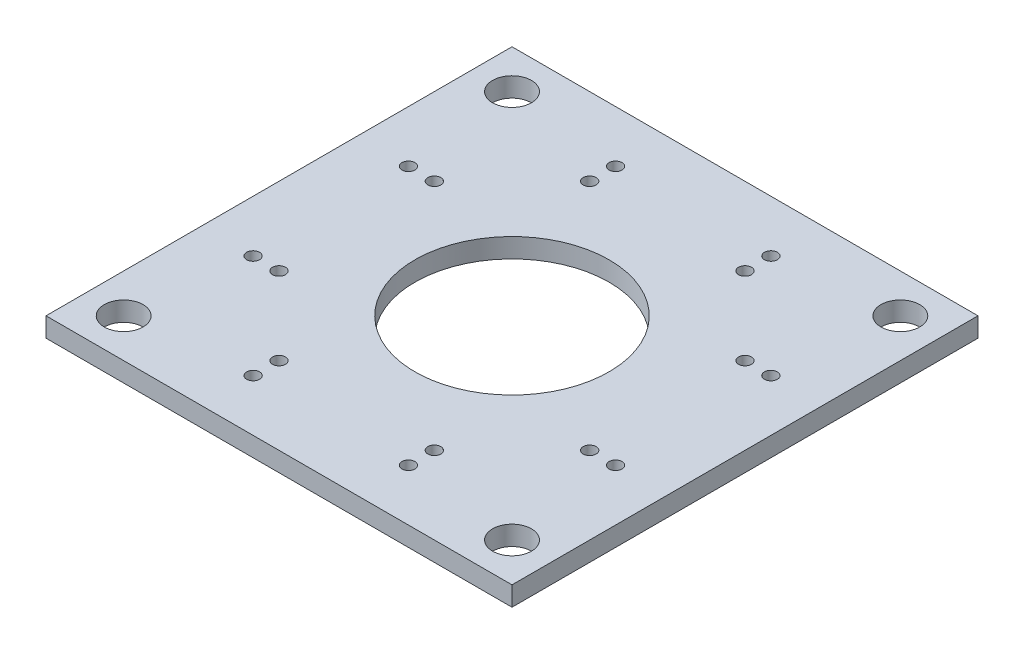
ISO-10303-21;
HEADER;
FILE_DESCRIPTION(('STEP AP214'),'2;1');
FILE_NAME('part.step','',(''),(''),'','','');
FILE_SCHEMA(('AUTOMOTIVE_DESIGN { 1 0 10303 214 1 1 1 1 }'));
ENDSEC;
DATA;
#1=APPLICATION_CONTEXT('core data for automotive mechanical design processes');
#2=APPLICATION_PROTOCOL_DEFINITION('international standard','automotive_design',2000,#1);
#3=PRODUCT_CONTEXT('',#1,'mechanical');
#4=PRODUCT('Part','Part','',(#3));
#5=PRODUCT_RELATED_PRODUCT_CATEGORY('part','',(#4));
#6=PRODUCT_DEFINITION_FORMATION('','',#4);
#7=PRODUCT_DEFINITION_CONTEXT('part definition',#1,'design');
#8=PRODUCT_DEFINITION('design','',#6,#7);
#9=PRODUCT_DEFINITION_SHAPE('','',#8);
#10=(LENGTH_UNIT() NAMED_UNIT(*) SI_UNIT(.MILLI.,.METRE.));
#11=(NAMED_UNIT(*) PLANE_ANGLE_UNIT() SI_UNIT($,.RADIAN.));
#12=(NAMED_UNIT(*) SI_UNIT($,.STERADIAN.) SOLID_ANGLE_UNIT());
#13=UNCERTAINTY_MEASURE_WITH_UNIT(LENGTH_MEASURE(1.E-05),#10,'distance_accuracy_value','');
#14=(GEOMETRIC_REPRESENTATION_CONTEXT(3) GLOBAL_UNCERTAINTY_ASSIGNED_CONTEXT((#13)) GLOBAL_UNIT_ASSIGNED_CONTEXT((#10,
#11,#12)) REPRESENTATION_CONTEXT('',''));
#15=CARTESIAN_POINT('',(0.,0.,0.));
#16=DIRECTION('',(0.,0.,1.));
#17=DIRECTION('',(1.,0.,0.));
#18=AXIS2_PLACEMENT_3D('',#15,#16,#17);
#19=CARTESIAN_POINT('',(0.,1.5,0.));
#20=DIRECTION('',(0.,1.,0.));
#21=DIRECTION('',(0.,0.,1.));
#22=AXIS2_PLACEMENT_3D('',#19,#20,#21);
#23=PLANE('',#22);
#24=CARTESIAN_POINT('',(-15.,1.5,15.));
#25=DIRECTION('',(0.,1.,0.));
#26=DIRECTION('',(0.,0.,1.));
#27=AXIS2_PLACEMENT_3D('',#24,#25,#26);
#28=CIRCLE('',#27,1.5);
#29=CARTESIAN_POINT('',(-15.,1.5,16.5));
#30=VERTEX_POINT('',#29);
#31=EDGE_CURVE('E142',#30,#30,#28,.F.);
#32=ORIENTED_EDGE('',*,*,#31,.T.);
#33=EDGE_LOOP('',(#32));
#34=FACE_BOUND('',#33,.T.);
#35=CARTESIAN_POINT('',(15.,1.5,15.));
#36=DIRECTION('',(0.,1.,0.));
#37=DIRECTION('',(0.,0.,1.));
#38=AXIS2_PLACEMENT_3D('',#35,#36,#37);
#39=CIRCLE('',#38,1.5);
#40=CARTESIAN_POINT('',(15.,1.5,16.5));
#41=VERTEX_POINT('',#40);
#42=EDGE_CURVE('E145',#41,#41,#39,.F.);
#43=ORIENTED_EDGE('',*,*,#42,.T.);
#44=EDGE_LOOP('',(#43));
#45=FACE_BOUND('',#44,.T.);
#46=CARTESIAN_POINT('',(15.,1.5,-15.));
#47=DIRECTION('',(0.,1.,0.));
#48=DIRECTION('',(0.,0.,1.));
#49=AXIS2_PLACEMENT_3D('',#46,#47,#48);
#50=CIRCLE('',#49,1.5);
#51=CARTESIAN_POINT('',(15.,1.5,-13.5));
#52=VERTEX_POINT('',#51);
#53=EDGE_CURVE('E148',#52,#52,#50,.F.);
#54=ORIENTED_EDGE('',*,*,#53,.T.);
#55=EDGE_LOOP('',(#54));
#56=FACE_BOUND('',#55,.T.);
#57=CARTESIAN_POINT('',(-15.,1.5,-15.));
#58=DIRECTION('',(0.,1.,0.));
#59=DIRECTION('',(0.,0.,1.));
#60=AXIS2_PLACEMENT_3D('',#57,#58,#59);
#61=CIRCLE('',#60,1.5);
#62=CARTESIAN_POINT('',(-15.,1.5,-13.5));
#63=VERTEX_POINT('',#62);
#64=EDGE_CURVE('E151',#63,#63,#61,.F.);
#65=ORIENTED_EDGE('',*,*,#64,.T.);
#66=EDGE_LOOP('',(#65));
#67=FACE_BOUND('',#66,.T.);
#68=CARTESIAN_POINT('',(0.,1.5,0.));
#69=DIRECTION('',(0.,-1.,0.));
#70=DIRECTION('',(0.,0.,-1.));
#71=AXIS2_PLACEMENT_3D('',#68,#69,#70);
#72=CIRCLE('',#71,7.5);
#73=CARTESIAN_POINT('',(0.,1.5,-7.5));
#74=VERTEX_POINT('',#73);
#75=EDGE_CURVE('E154',#74,#74,#72,.T.);
#76=ORIENTED_EDGE('',*,*,#75,.T.);
#77=EDGE_LOOP('',(#76));
#78=FACE_BOUND('',#77,.T.);
#79=CARTESIAN_POINT('',(12.,1.5,6.));
#80=DIRECTION('',(0.,1.,0.));
#81=DIRECTION('',(0.,0.,1.));
#82=AXIS2_PLACEMENT_3D('',#79,#80,#81);
#83=CIRCLE('',#82,0.5);
#84=CARTESIAN_POINT('',(12.,1.5,6.5));
#85=VERTEX_POINT('',#84);
#86=EDGE_CURVE('E157',#85,#85,#83,.F.);
#87=ORIENTED_EDGE('',*,*,#86,.T.);
#88=EDGE_LOOP('',(#87));
#89=FACE_BOUND('',#88,.T.);
#90=CARTESIAN_POINT('',(14.,1.5,6.));
#91=DIRECTION('',(0.,1.,0.));
#92=DIRECTION('',(0.,0.,1.));
#93=AXIS2_PLACEMENT_3D('',#90,#91,#92);
#94=CIRCLE('',#93,0.5);
#95=CARTESIAN_POINT('',(14.,1.5,6.5));
#96=VERTEX_POINT('',#95);
#97=EDGE_CURVE('E160',#96,#96,#94,.F.);
#98=ORIENTED_EDGE('',*,*,#97,.T.);
#99=EDGE_LOOP('',(#98));
#100=FACE_BOUND('',#99,.T.);
#101=CARTESIAN_POINT('',(12.,1.5,-6.));
#102=DIRECTION('',(0.,1.,0.));
#103=DIRECTION('',(0.,0.,1.));
#104=AXIS2_PLACEMENT_3D('',#101,#102,#103);
#105=CIRCLE('',#104,0.5);
#106=CARTESIAN_POINT('',(12.,1.5,-5.5));
#107=VERTEX_POINT('',#106);
#108=EDGE_CURVE('E163',#107,#107,#105,.F.);
#109=ORIENTED_EDGE('',*,*,#108,.T.);
#110=EDGE_LOOP('',(#109));
#111=FACE_BOUND('',#110,.T.);
#112=CARTESIAN_POINT('',(14.,1.5,-6.));
#113=DIRECTION('',(0.,1.,0.));
#114=DIRECTION('',(0.,0.,1.));
#115=AXIS2_PLACEMENT_3D('',#112,#113,#114);
#116=CIRCLE('',#115,0.5);
#117=CARTESIAN_POINT('',(14.,1.5,-5.5));
#118=VERTEX_POINT('',#117);
#119=EDGE_CURVE('E166',#118,#118,#116,.F.);
#120=ORIENTED_EDGE('',*,*,#119,.T.);
#121=EDGE_LOOP('',(#120));
#122=FACE_BOUND('',#121,.T.);
#123=CARTESIAN_POINT('',(-12.,1.5,6.));
#124=DIRECTION('',(0.,1.,0.));
#125=DIRECTION('',(0.,0.,1.));
#126=AXIS2_PLACEMENT_3D('',#123,#124,#125);
#127=CIRCLE('',#126,0.5);
#128=CARTESIAN_POINT('',(-12.,1.5,6.5));
#129=VERTEX_POINT('',#128);
#130=EDGE_CURVE('E169',#129,#129,#127,.F.);
#131=ORIENTED_EDGE('',*,*,#130,.T.);
#132=EDGE_LOOP('',(#131));
#133=FACE_BOUND('',#132,.T.);
#134=CARTESIAN_POINT('',(-14.,1.5,6.));
#135=DIRECTION('',(0.,1.,0.));
#136=DIRECTION('',(0.,0.,1.));
#137=AXIS2_PLACEMENT_3D('',#134,#135,#136);
#138=CIRCLE('',#137,0.5);
#139=CARTESIAN_POINT('',(-14.,1.5,6.5));
#140=VERTEX_POINT('',#139);
#141=EDGE_CURVE('E172',#140,#140,#138,.F.);
#142=ORIENTED_EDGE('',*,*,#141,.T.);
#143=EDGE_LOOP('',(#142));
#144=FACE_BOUND('',#143,.T.);
#145=CARTESIAN_POINT('',(-12.,1.5,-6.));
#146=DIRECTION('',(0.,1.,0.));
#147=DIRECTION('',(0.,0.,1.));
#148=AXIS2_PLACEMENT_3D('',#145,#146,#147);
#149=CIRCLE('',#148,0.5);
#150=CARTESIAN_POINT('',(-12.,1.5,-5.5));
#151=VERTEX_POINT('',#150);
#152=EDGE_CURVE('E175',#151,#151,#149,.F.);
#153=ORIENTED_EDGE('',*,*,#152,.T.);
#154=EDGE_LOOP('',(#153));
#155=FACE_BOUND('',#154,.T.);
#156=CARTESIAN_POINT('',(-14.,1.5,-6.));
#157=DIRECTION('',(0.,1.,0.));
#158=DIRECTION('',(0.,0.,1.));
#159=AXIS2_PLACEMENT_3D('',#156,#157,#158);
#160=CIRCLE('',#159,0.5);
#161=CARTESIAN_POINT('',(-14.,1.5,-5.5));
#162=VERTEX_POINT('',#161);
#163=EDGE_CURVE('E178',#162,#162,#160,.F.);
#164=ORIENTED_EDGE('',*,*,#163,.T.);
#165=EDGE_LOOP('',(#164));
#166=FACE_BOUND('',#165,.T.);
#167=CARTESIAN_POINT('',(6.,1.5,12.));
#168=DIRECTION('',(0.,1.,0.));
#169=DIRECTION('',(0.,0.,1.));
#170=AXIS2_PLACEMENT_3D('',#167,#168,#169);
#171=CIRCLE('',#170,0.5);
#172=CARTESIAN_POINT('',(6.,1.5,12.5));
#173=VERTEX_POINT('',#172);
#174=EDGE_CURVE('E181',#173,#173,#171,.F.);
#175=ORIENTED_EDGE('',*,*,#174,.T.);
#176=EDGE_LOOP('',(#175));
#177=FACE_BOUND('',#176,.T.);
#178=CARTESIAN_POINT('',(6.,1.5,14.));
#179=DIRECTION('',(0.,1.,0.));
#180=DIRECTION('',(0.,0.,1.));
#181=AXIS2_PLACEMENT_3D('',#178,#179,#180);
#182=CIRCLE('',#181,0.5);
#183=CARTESIAN_POINT('',(6.,1.5,14.5));
#184=VERTEX_POINT('',#183);
#185=EDGE_CURVE('E184',#184,#184,#182,.F.);
#186=ORIENTED_EDGE('',*,*,#185,.T.);
#187=EDGE_LOOP('',(#186));
#188=FACE_BOUND('',#187,.T.);
#189=CARTESIAN_POINT('',(-6.,1.5,12.));
#190=DIRECTION('',(0.,1.,0.));
#191=DIRECTION('',(0.,0.,1.));
#192=AXIS2_PLACEMENT_3D('',#189,#190,#191);
#193=CIRCLE('',#192,0.5);
#194=CARTESIAN_POINT('',(-6.,1.5,12.5));
#195=VERTEX_POINT('',#194);
#196=EDGE_CURVE('E187',#195,#195,#193,.F.);
#197=ORIENTED_EDGE('',*,*,#196,.T.);
#198=EDGE_LOOP('',(#197));
#199=FACE_BOUND('',#198,.T.);
#200=CARTESIAN_POINT('',(-6.,1.5,14.));
#201=DIRECTION('',(0.,1.,0.));
#202=DIRECTION('',(0.,0.,1.));
#203=AXIS2_PLACEMENT_3D('',#200,#201,#202);
#204=CIRCLE('',#203,0.5);
#205=CARTESIAN_POINT('',(-6.,1.5,14.5));
#206=VERTEX_POINT('',#205);
#207=EDGE_CURVE('E190',#206,#206,#204,.F.);
#208=ORIENTED_EDGE('',*,*,#207,.T.);
#209=EDGE_LOOP('',(#208));
#210=FACE_BOUND('',#209,.T.);
#211=CARTESIAN_POINT('',(6.,1.5,-12.));
#212=DIRECTION('',(0.,1.,0.));
#213=DIRECTION('',(0.,0.,1.));
#214=AXIS2_PLACEMENT_3D('',#211,#212,#213);
#215=CIRCLE('',#214,0.5);
#216=CARTESIAN_POINT('',(6.,1.5,-11.5));
#217=VERTEX_POINT('',#216);
#218=EDGE_CURVE('E193',#217,#217,#215,.F.);
#219=ORIENTED_EDGE('',*,*,#218,.T.);
#220=EDGE_LOOP('',(#219));
#221=FACE_BOUND('',#220,.T.);
#222=CARTESIAN_POINT('',(6.,1.5,-14.));
#223=DIRECTION('',(0.,1.,0.));
#224=DIRECTION('',(0.,0.,1.));
#225=AXIS2_PLACEMENT_3D('',#222,#223,#224);
#226=CIRCLE('',#225,0.5);
#227=CARTESIAN_POINT('',(6.,1.5,-13.5));
#228=VERTEX_POINT('',#227);
#229=EDGE_CURVE('E196',#228,#228,#226,.F.);
#230=ORIENTED_EDGE('',*,*,#229,.T.);
#231=EDGE_LOOP('',(#230));
#232=FACE_BOUND('',#231,.T.);
#233=CARTESIAN_POINT('',(-6.,1.5,-12.));
#234=DIRECTION('',(0.,1.,0.));
#235=DIRECTION('',(0.,0.,1.));
#236=AXIS2_PLACEMENT_3D('',#233,#234,#235);
#237=CIRCLE('',#236,0.5);
#238=CARTESIAN_POINT('',(-6.,1.5,-11.5));
#239=VERTEX_POINT('',#238);
#240=EDGE_CURVE('E198',#239,#239,#237,.F.);
#241=ORIENTED_EDGE('',*,*,#240,.T.);
#242=EDGE_LOOP('',(#241));
#243=FACE_BOUND('',#242,.T.);
#244=CARTESIAN_POINT('',(-6.,1.5,-14.));
#245=DIRECTION('',(0.,1.,0.));
#246=DIRECTION('',(0.,0.,1.));
#247=AXIS2_PLACEMENT_3D('',#244,#245,#246);
#248=CIRCLE('',#247,0.5);
#249=CARTESIAN_POINT('',(-6.,1.5,-13.5));
#250=VERTEX_POINT('',#249);
#251=EDGE_CURVE('E19',#250,#250,#248,.F.);
#252=ORIENTED_EDGE('',*,*,#251,.T.);
#253=EDGE_LOOP('',(#252));
#254=FACE_BOUND('',#253,.T.);
#255=DIRECTION('',(-1.,0.,0.));
#256=VECTOR('',#255,1.);
#257=CARTESIAN_POINT('',(18.,1.5,-18.));
#258=LINE('',#257,#256);
#259=CARTESIAN_POINT('',(-18.,1.5,-18.));
#260=VERTEX_POINT('',#259);
#261=CARTESIAN_POINT('',(18.,1.5,-18.));
#262=VERTEX_POINT('',#261);
#263=EDGE_CURVE('E70',#260,#262,#258,.F.);
#264=ORIENTED_EDGE('',*,*,#263,.F.);
#265=DIRECTION('',(0.,0.,1.));
#266=VECTOR('',#265,1.);
#267=CARTESIAN_POINT('',(-18.,1.5,-18.));
#268=LINE('',#267,#266);
#269=CARTESIAN_POINT('',(-18.,1.5,18.));
#270=VERTEX_POINT('',#269);
#271=EDGE_CURVE('E67',#270,#260,#268,.F.);
#272=ORIENTED_EDGE('',*,*,#271,.F.);
#273=DIRECTION('',(1.,0.,0.));
#274=VECTOR('',#273,1.);
#275=CARTESIAN_POINT('',(-18.,1.5,18.));
#276=LINE('',#275,#274);
#277=CARTESIAN_POINT('',(18.,1.5,18.));
#278=VERTEX_POINT('',#277);
#279=EDGE_CURVE('E58',#278,#270,#276,.F.);
#280=ORIENTED_EDGE('',*,*,#279,.F.);
#281=DIRECTION('',(0.,0.,-1.));
#282=VECTOR('',#281,1.);
#283=CARTESIAN_POINT('',(18.,1.5,18.));
#284=LINE('',#283,#282);
#285=EDGE_CURVE('E53',#262,#278,#284,.F.);
#286=ORIENTED_EDGE('',*,*,#285,.F.);
#287=EDGE_LOOP('',(#264,#272,#280,#286));
#288=FACE_BOUND('',#287,.T.);
#289=ADVANCED_FACE('F16',(#34,#45,#56,#67,#78,#89,#100,#111,#122,#133,#144,#155,#166,#177,#188,
#199,#210,#221,#232,#243,#254,#288),#23,.T.);
#290=CARTESIAN_POINT('',(-18.,0.,-18.));
#291=DIRECTION('',(-1.,0.,0.));
#292=DIRECTION('',(0.,0.,1.));
#293=AXIS2_PLACEMENT_3D('',#290,#291,#292);
#294=PLANE('',#293);
#295=DIRECTION('',(0.,1.,0.));
#296=VECTOR('',#295,1.);
#297=CARTESIAN_POINT('',(-18.,0.,-18.));
#298=LINE('',#297,#296);
#299=CARTESIAN_POINT('',(-18.,0.,-18.));
#300=VERTEX_POINT('',#299);
#301=EDGE_CURVE('E206',#300,#260,#298,.T.);
#302=ORIENTED_EDGE('',*,*,#301,.F.);
#303=DIRECTION('',(0.,0.,1.));
#304=VECTOR('',#303,1.);
#305=CARTESIAN_POINT('',(-18.,0.,0.));
#306=LINE('',#305,#304);
#307=CARTESIAN_POINT('',(-18.,0.,18.));
#308=VERTEX_POINT('',#307);
#309=EDGE_CURVE('E77',#300,#308,#306,.T.);
#310=ORIENTED_EDGE('',*,*,#309,.T.);
#311=DIRECTION('',(0.,1.,0.));
#312=VECTOR('',#311,1.);
#313=CARTESIAN_POINT('',(-18.,0.,18.));
#314=LINE('',#313,#312);
#315=EDGE_CURVE('E63',#270,#308,#314,.F.);
#316=ORIENTED_EDGE('',*,*,#315,.F.);
#317=ORIENTED_EDGE('',*,*,#271,.T.);
#318=EDGE_LOOP('',(#302,#310,#316,#317));
#319=FACE_BOUND('',#318,.T.);
#320=ADVANCED_FACE('F76',(#319),#294,.T.);
#321=CARTESIAN_POINT('',(-18.,0.,18.));
#322=DIRECTION('',(0.,0.,1.));
#323=DIRECTION('',(1.,0.,0.));
#324=AXIS2_PLACEMENT_3D('',#321,#322,#323);
#325=PLANE('',#324);
#326=ORIENTED_EDGE('',*,*,#315,.T.);
#327=DIRECTION('',(1.,0.,0.));
#328=VECTOR('',#327,1.);
#329=CARTESIAN_POINT('',(0.,0.,18.));
#330=LINE('',#329,#328);
#331=CARTESIAN_POINT('',(18.,0.,18.));
#332=VERTEX_POINT('',#331);
#333=EDGE_CURVE('E217',#308,#332,#330,.T.);
#334=ORIENTED_EDGE('',*,*,#333,.T.);
#335=DIRECTION('',(0.,1.,0.));
#336=VECTOR('',#335,1.);
#337=CARTESIAN_POINT('',(18.,0.,18.));
#338=LINE('',#337,#336);
#339=EDGE_CURVE('E65',#278,#332,#338,.F.);
#340=ORIENTED_EDGE('',*,*,#339,.F.);
#341=ORIENTED_EDGE('',*,*,#279,.T.);
#342=EDGE_LOOP('',(#326,#334,#340,#341));
#343=FACE_BOUND('',#342,.T.);
#344=ADVANCED_FACE('F60',(#343),#325,.T.);
#345=CARTESIAN_POINT('',(18.,0.,18.));
#346=DIRECTION('',(1.,0.,0.));
#347=DIRECTION('',(0.,0.,-1.));
#348=AXIS2_PLACEMENT_3D('',#345,#346,#347);
#349=PLANE('',#348);
#350=ORIENTED_EDGE('',*,*,#339,.T.);
#351=DIRECTION('',(0.,0.,1.));
#352=VECTOR('',#351,1.);
#353=CARTESIAN_POINT('',(18.,0.,0.));
#354=LINE('',#353,#352);
#355=CARTESIAN_POINT('',(18.,0.,-18.));
#356=VERTEX_POINT('',#355);
#357=EDGE_CURVE('E214',#332,#356,#354,.F.);
#358=ORIENTED_EDGE('',*,*,#357,.T.);
#359=DIRECTION('',(0.,1.,0.));
#360=VECTOR('',#359,1.);
#361=CARTESIAN_POINT('',(18.,0.,-18.));
#362=LINE('',#361,#360);
#363=EDGE_CURVE('E34',#262,#356,#362,.F.);
#364=ORIENTED_EDGE('',*,*,#363,.F.);
#365=ORIENTED_EDGE('',*,*,#285,.T.);
#366=EDGE_LOOP('',(#350,#358,#364,#365));
#367=FACE_BOUND('',#366,.T.);
#368=ADVANCED_FACE('F213',(#367),#349,.T.);
#369=CARTESIAN_POINT('',(18.,0.,-18.));
#370=DIRECTION('',(0.,0.,-1.));
#371=DIRECTION('',(-1.,0.,0.));
#372=AXIS2_PLACEMENT_3D('',#369,#370,#371);
#373=PLANE('',#372);
#374=ORIENTED_EDGE('',*,*,#363,.T.);
#375=DIRECTION('',(1.,0.,0.));
#376=VECTOR('',#375,1.);
#377=CARTESIAN_POINT('',(0.,0.,-18.));
#378=LINE('',#377,#376);
#379=EDGE_CURVE('E141',#356,#300,#378,.F.);
#380=ORIENTED_EDGE('',*,*,#379,.T.);
#381=ORIENTED_EDGE('',*,*,#301,.T.);
#382=ORIENTED_EDGE('',*,*,#263,.T.);
#383=EDGE_LOOP('',(#374,#380,#381,#382));
#384=FACE_BOUND('',#383,.T.);
#385=ADVANCED_FACE('F220',(#384),#373,.T.);
#386=CARTESIAN_POINT('',(-6.,1.5,-14.));
#387=DIRECTION('',(0.,1.,0.));
#388=DIRECTION('',(0.,0.,1.));
#389=AXIS2_PLACEMENT_3D('',#386,#387,#388);
#390=CYLINDRICAL_SURFACE('',#389,0.5);
#391=ORIENTED_EDGE('',*,*,#251,.F.);
#392=EDGE_LOOP('',(#391));
#393=FACE_BOUND('',#392,.T.);
#394=CARTESIAN_POINT('',(-6.,0.,-14.));
#395=DIRECTION('',(0.,1.,0.));
#396=DIRECTION('',(0.,0.,1.));
#397=AXIS2_PLACEMENT_3D('',#394,#395,#396);
#398=CIRCLE('',#397,0.5);
#399=CARTESIAN_POINT('',(-6.,0.,-13.5));
#400=VERTEX_POINT('',#399);
#401=EDGE_CURVE('E138',#400,#400,#398,.F.);
#402=ORIENTED_EDGE('',*,*,#401,.T.);
#403=EDGE_LOOP('',(#402));
#404=FACE_BOUND('',#403,.T.);
#405=ADVANCED_FACE('F222',(#393,#404),#390,.F.);
#406=CARTESIAN_POINT('',(-6.,1.5,-12.));
#407=DIRECTION('',(0.,1.,0.));
#408=DIRECTION('',(0.,0.,1.));
#409=AXIS2_PLACEMENT_3D('',#406,#407,#408);
#410=CYLINDRICAL_SURFACE('',#409,0.5);
#411=ORIENTED_EDGE('',*,*,#240,.F.);
#412=EDGE_LOOP('',(#411));
#413=FACE_BOUND('',#412,.T.);
#414=CARTESIAN_POINT('',(-6.,0.,-12.));
#415=DIRECTION('',(0.,1.,0.));
#416=DIRECTION('',(0.,0.,1.));
#417=AXIS2_PLACEMENT_3D('',#414,#415,#416);
#418=CIRCLE('',#417,0.5);
#419=CARTESIAN_POINT('',(-6.,0.,-11.5));
#420=VERTEX_POINT('',#419);
#421=EDGE_CURVE('E135',#420,#420,#418,.F.);
#422=ORIENTED_EDGE('',*,*,#421,.T.);
#423=EDGE_LOOP('',(#422));
#424=FACE_BOUND('',#423,.T.);
#425=ADVANCED_FACE('F229',(#413,#424),#410,.F.);
#426=CARTESIAN_POINT('',(6.,1.5,-14.));
#427=DIRECTION('',(0.,1.,0.));
#428=DIRECTION('',(0.,0.,1.));
#429=AXIS2_PLACEMENT_3D('',#426,#427,#428);
#430=CYLINDRICAL_SURFACE('',#429,0.5);
#431=ORIENTED_EDGE('',*,*,#229,.F.);
#432=EDGE_LOOP('',(#431));
#433=FACE_BOUND('',#432,.T.);
#434=CARTESIAN_POINT('',(6.,0.,-14.));
#435=DIRECTION('',(0.,1.,0.));
#436=DIRECTION('',(0.,0.,1.));
#437=AXIS2_PLACEMENT_3D('',#434,#435,#436);
#438=CIRCLE('',#437,0.5);
#439=CARTESIAN_POINT('',(6.,0.,-13.5));
#440=VERTEX_POINT('',#439);
#441=EDGE_CURVE('E132',#440,#440,#438,.F.);
#442=ORIENTED_EDGE('',*,*,#441,.T.);
#443=EDGE_LOOP('',(#442));
#444=FACE_BOUND('',#443,.T.);
#445=ADVANCED_FACE('F312',(#433,#444),#430,.F.);
#446=CARTESIAN_POINT('',(6.,1.5,-12.));
#447=DIRECTION('',(0.,1.,0.));
#448=DIRECTION('',(0.,0.,1.));
#449=AXIS2_PLACEMENT_3D('',#446,#447,#448);
#450=CYLINDRICAL_SURFACE('',#449,0.5);
#451=ORIENTED_EDGE('',*,*,#218,.F.);
#452=EDGE_LOOP('',(#451));
#453=FACE_BOUND('',#452,.T.);
#454=CARTESIAN_POINT('',(6.,0.,-12.));
#455=DIRECTION('',(0.,1.,0.));
#456=DIRECTION('',(0.,0.,1.));
#457=AXIS2_PLACEMENT_3D('',#454,#455,#456);
#458=CIRCLE('',#457,0.5);
#459=CARTESIAN_POINT('',(6.,0.,-11.5));
#460=VERTEX_POINT('',#459);
#461=EDGE_CURVE('E129',#460,#460,#458,.F.);
#462=ORIENTED_EDGE('',*,*,#461,.T.);
#463=EDGE_LOOP('',(#462));
#464=FACE_BOUND('',#463,.T.);
#465=ADVANCED_FACE('F308',(#453,#464),#450,.F.);
#466=CARTESIAN_POINT('',(-6.,1.5,14.));
#467=DIRECTION('',(0.,1.,0.));
#468=DIRECTION('',(0.,0.,1.));
#469=AXIS2_PLACEMENT_3D('',#466,#467,#468);
#470=CYLINDRICAL_SURFACE('',#469,0.5);
#471=ORIENTED_EDGE('',*,*,#207,.F.);
#472=EDGE_LOOP('',(#471));
#473=FACE_BOUND('',#472,.T.);
#474=CARTESIAN_POINT('',(-6.,0.,14.));
#475=DIRECTION('',(0.,1.,0.));
#476=DIRECTION('',(0.,0.,1.));
#477=AXIS2_PLACEMENT_3D('',#474,#475,#476);
#478=CIRCLE('',#477,0.5);
#479=CARTESIAN_POINT('',(-6.,0.,14.5));
#480=VERTEX_POINT('',#479);
#481=EDGE_CURVE('E126',#480,#480,#478,.F.);
#482=ORIENTED_EDGE('',*,*,#481,.T.);
#483=EDGE_LOOP('',(#482));
#484=FACE_BOUND('',#483,.T.);
#485=ADVANCED_FACE('F304',(#473,#484),#470,.F.);
#486=CARTESIAN_POINT('',(-6.,1.5,12.));
#487=DIRECTION('',(0.,1.,0.));
#488=DIRECTION('',(0.,0.,1.));
#489=AXIS2_PLACEMENT_3D('',#486,#487,#488);
#490=CYLINDRICAL_SURFACE('',#489,0.5);
#491=ORIENTED_EDGE('',*,*,#196,.F.);
#492=EDGE_LOOP('',(#491));
#493=FACE_BOUND('',#492,.T.);
#494=CARTESIAN_POINT('',(-6.,0.,12.));
#495=DIRECTION('',(0.,1.,0.));
#496=DIRECTION('',(0.,0.,1.));
#497=AXIS2_PLACEMENT_3D('',#494,#495,#496);
#498=CIRCLE('',#497,0.5);
#499=CARTESIAN_POINT('',(-6.,0.,12.5));
#500=VERTEX_POINT('',#499);
#501=EDGE_CURVE('E123',#500,#500,#498,.F.);
#502=ORIENTED_EDGE('',*,*,#501,.T.);
#503=EDGE_LOOP('',(#502));
#504=FACE_BOUND('',#503,.T.);
#505=ADVANCED_FACE('F300',(#493,#504),#490,.F.);
#506=CARTESIAN_POINT('',(6.,1.5,14.));
#507=DIRECTION('',(0.,1.,0.));
#508=DIRECTION('',(0.,0.,1.));
#509=AXIS2_PLACEMENT_3D('',#506,#507,#508);
#510=CYLINDRICAL_SURFACE('',#509,0.5);
#511=ORIENTED_EDGE('',*,*,#185,.F.);
#512=EDGE_LOOP('',(#511));
#513=FACE_BOUND('',#512,.T.);
#514=CARTESIAN_POINT('',(6.,0.,14.));
#515=DIRECTION('',(0.,1.,0.));
#516=DIRECTION('',(0.,0.,1.));
#517=AXIS2_PLACEMENT_3D('',#514,#515,#516);
#518=CIRCLE('',#517,0.5);
#519=CARTESIAN_POINT('',(6.,0.,14.5));
#520=VERTEX_POINT('',#519);
#521=EDGE_CURVE('E120',#520,#520,#518,.F.);
#522=ORIENTED_EDGE('',*,*,#521,.T.);
#523=EDGE_LOOP('',(#522));
#524=FACE_BOUND('',#523,.T.);
#525=ADVANCED_FACE('F296',(#513,#524),#510,.F.);
#526=CARTESIAN_POINT('',(6.,1.5,12.));
#527=DIRECTION('',(0.,1.,0.));
#528=DIRECTION('',(0.,0.,1.));
#529=AXIS2_PLACEMENT_3D('',#526,#527,#528);
#530=CYLINDRICAL_SURFACE('',#529,0.5);
#531=ORIENTED_EDGE('',*,*,#174,.F.);
#532=EDGE_LOOP('',(#531));
#533=FACE_BOUND('',#532,.T.);
#534=CARTESIAN_POINT('',(6.,0.,12.));
#535=DIRECTION('',(0.,1.,0.));
#536=DIRECTION('',(0.,0.,1.));
#537=AXIS2_PLACEMENT_3D('',#534,#535,#536);
#538=CIRCLE('',#537,0.5);
#539=CARTESIAN_POINT('',(6.,0.,12.5));
#540=VERTEX_POINT('',#539);
#541=EDGE_CURVE('E117',#540,#540,#538,.F.);
#542=ORIENTED_EDGE('',*,*,#541,.T.);
#543=EDGE_LOOP('',(#542));
#544=FACE_BOUND('',#543,.T.);
#545=ADVANCED_FACE('F292',(#533,#544),#530,.F.);
#546=CARTESIAN_POINT('',(-14.,1.5,-6.));
#547=DIRECTION('',(0.,1.,0.));
#548=DIRECTION('',(0.,0.,1.));
#549=AXIS2_PLACEMENT_3D('',#546,#547,#548);
#550=CYLINDRICAL_SURFACE('',#549,0.5);
#551=ORIENTED_EDGE('',*,*,#163,.F.);
#552=EDGE_LOOP('',(#551));
#553=FACE_BOUND('',#552,.T.);
#554=CARTESIAN_POINT('',(-14.,0.,-6.));
#555=DIRECTION('',(0.,1.,0.));
#556=DIRECTION('',(0.,0.,1.));
#557=AXIS2_PLACEMENT_3D('',#554,#555,#556);
#558=CIRCLE('',#557,0.5);
#559=CARTESIAN_POINT('',(-14.,0.,-5.5));
#560=VERTEX_POINT('',#559);
#561=EDGE_CURVE('E114',#560,#560,#558,.F.);
#562=ORIENTED_EDGE('',*,*,#561,.T.);
#563=EDGE_LOOP('',(#562));
#564=FACE_BOUND('',#563,.T.);
#565=ADVANCED_FACE('F288',(#553,#564),#550,.F.);
#566=CARTESIAN_POINT('',(-12.,1.5,-6.));
#567=DIRECTION('',(0.,1.,0.));
#568=DIRECTION('',(0.,0.,1.));
#569=AXIS2_PLACEMENT_3D('',#566,#567,#568);
#570=CYLINDRICAL_SURFACE('',#569,0.5);
#571=ORIENTED_EDGE('',*,*,#152,.F.);
#572=EDGE_LOOP('',(#571));
#573=FACE_BOUND('',#572,.T.);
#574=CARTESIAN_POINT('',(-12.,0.,-6.));
#575=DIRECTION('',(0.,1.,0.));
#576=DIRECTION('',(0.,0.,1.));
#577=AXIS2_PLACEMENT_3D('',#574,#575,#576);
#578=CIRCLE('',#577,0.5);
#579=CARTESIAN_POINT('',(-12.,0.,-5.5));
#580=VERTEX_POINT('',#579);
#581=EDGE_CURVE('E111',#580,#580,#578,.F.);
#582=ORIENTED_EDGE('',*,*,#581,.T.);
#583=EDGE_LOOP('',(#582));
#584=FACE_BOUND('',#583,.T.);
#585=ADVANCED_FACE('F284',(#573,#584),#570,.F.);
#586=CARTESIAN_POINT('',(-14.,1.5,6.));
#587=DIRECTION('',(0.,1.,0.));
#588=DIRECTION('',(0.,0.,1.));
#589=AXIS2_PLACEMENT_3D('',#586,#587,#588);
#590=CYLINDRICAL_SURFACE('',#589,0.5);
#591=ORIENTED_EDGE('',*,*,#141,.F.);
#592=EDGE_LOOP('',(#591));
#593=FACE_BOUND('',#592,.T.);
#594=CARTESIAN_POINT('',(-14.,0.,6.));
#595=DIRECTION('',(0.,1.,0.));
#596=DIRECTION('',(0.,0.,1.));
#597=AXIS2_PLACEMENT_3D('',#594,#595,#596);
#598=CIRCLE('',#597,0.5);
#599=CARTESIAN_POINT('',(-14.,0.,6.5));
#600=VERTEX_POINT('',#599);
#601=EDGE_CURVE('E108',#600,#600,#598,.F.);
#602=ORIENTED_EDGE('',*,*,#601,.T.);
#603=EDGE_LOOP('',(#602));
#604=FACE_BOUND('',#603,.T.);
#605=ADVANCED_FACE('F280',(#593,#604),#590,.F.);
#606=CARTESIAN_POINT('',(-12.,1.5,6.));
#607=DIRECTION('',(0.,1.,0.));
#608=DIRECTION('',(0.,0.,1.));
#609=AXIS2_PLACEMENT_3D('',#606,#607,#608);
#610=CYLINDRICAL_SURFACE('',#609,0.5);
#611=ORIENTED_EDGE('',*,*,#130,.F.);
#612=EDGE_LOOP('',(#611));
#613=FACE_BOUND('',#612,.T.);
#614=CARTESIAN_POINT('',(-12.,0.,6.));
#615=DIRECTION('',(0.,1.,0.));
#616=DIRECTION('',(0.,0.,1.));
#617=AXIS2_PLACEMENT_3D('',#614,#615,#616);
#618=CIRCLE('',#617,0.5);
#619=CARTESIAN_POINT('',(-12.,0.,6.5));
#620=VERTEX_POINT('',#619);
#621=EDGE_CURVE('E105',#620,#620,#618,.F.);
#622=ORIENTED_EDGE('',*,*,#621,.T.);
#623=EDGE_LOOP('',(#622));
#624=FACE_BOUND('',#623,.T.);
#625=ADVANCED_FACE('F276',(#613,#624),#610,.F.);
#626=CARTESIAN_POINT('',(14.,1.5,-6.));
#627=DIRECTION('',(0.,1.,0.));
#628=DIRECTION('',(0.,0.,1.));
#629=AXIS2_PLACEMENT_3D('',#626,#627,#628);
#630=CYLINDRICAL_SURFACE('',#629,0.5);
#631=ORIENTED_EDGE('',*,*,#119,.F.);
#632=EDGE_LOOP('',(#631));
#633=FACE_BOUND('',#632,.T.);
#634=CARTESIAN_POINT('',(14.,0.,-6.));
#635=DIRECTION('',(0.,1.,0.));
#636=DIRECTION('',(0.,0.,1.));
#637=AXIS2_PLACEMENT_3D('',#634,#635,#636);
#638=CIRCLE('',#637,0.5);
#639=CARTESIAN_POINT('',(14.,0.,-5.5));
#640=VERTEX_POINT('',#639);
#641=EDGE_CURVE('E102',#640,#640,#638,.F.);
#642=ORIENTED_EDGE('',*,*,#641,.T.);
#643=EDGE_LOOP('',(#642));
#644=FACE_BOUND('',#643,.T.);
#645=ADVANCED_FACE('F272',(#633,#644),#630,.F.);
#646=CARTESIAN_POINT('',(12.,1.5,-6.));
#647=DIRECTION('',(0.,1.,0.));
#648=DIRECTION('',(0.,0.,1.));
#649=AXIS2_PLACEMENT_3D('',#646,#647,#648);
#650=CYLINDRICAL_SURFACE('',#649,0.5);
#651=ORIENTED_EDGE('',*,*,#108,.F.);
#652=EDGE_LOOP('',(#651));
#653=FACE_BOUND('',#652,.T.);
#654=CARTESIAN_POINT('',(12.,0.,-6.));
#655=DIRECTION('',(0.,1.,0.));
#656=DIRECTION('',(0.,0.,1.));
#657=AXIS2_PLACEMENT_3D('',#654,#655,#656);
#658=CIRCLE('',#657,0.5);
#659=CARTESIAN_POINT('',(12.,0.,-5.5));
#660=VERTEX_POINT('',#659);
#661=EDGE_CURVE('E99',#660,#660,#658,.F.);
#662=ORIENTED_EDGE('',*,*,#661,.T.);
#663=EDGE_LOOP('',(#662));
#664=FACE_BOUND('',#663,.T.);
#665=ADVANCED_FACE('F268',(#653,#664),#650,.F.);
#666=CARTESIAN_POINT('',(14.,1.5,6.));
#667=DIRECTION('',(0.,1.,0.));
#668=DIRECTION('',(0.,0.,1.));
#669=AXIS2_PLACEMENT_3D('',#666,#667,#668);
#670=CYLINDRICAL_SURFACE('',#669,0.5);
#671=ORIENTED_EDGE('',*,*,#97,.F.);
#672=EDGE_LOOP('',(#671));
#673=FACE_BOUND('',#672,.T.);
#674=CARTESIAN_POINT('',(14.,0.,6.));
#675=DIRECTION('',(0.,1.,0.));
#676=DIRECTION('',(0.,0.,1.));
#677=AXIS2_PLACEMENT_3D('',#674,#675,#676);
#678=CIRCLE('',#677,0.5);
#679=CARTESIAN_POINT('',(14.,0.,6.5));
#680=VERTEX_POINT('',#679);
#681=EDGE_CURVE('E96',#680,#680,#678,.F.);
#682=ORIENTED_EDGE('',*,*,#681,.T.);
#683=EDGE_LOOP('',(#682));
#684=FACE_BOUND('',#683,.T.);
#685=ADVANCED_FACE('F264',(#673,#684),#670,.F.);
#686=CARTESIAN_POINT('',(12.,1.5,6.));
#687=DIRECTION('',(0.,1.,0.));
#688=DIRECTION('',(0.,0.,1.));
#689=AXIS2_PLACEMENT_3D('',#686,#687,#688);
#690=CYLINDRICAL_SURFACE('',#689,0.5);
#691=ORIENTED_EDGE('',*,*,#86,.F.);
#692=EDGE_LOOP('',(#691));
#693=FACE_BOUND('',#692,.T.);
#694=CARTESIAN_POINT('',(12.,0.,6.));
#695=DIRECTION('',(0.,1.,0.));
#696=DIRECTION('',(0.,0.,1.));
#697=AXIS2_PLACEMENT_3D('',#694,#695,#696);
#698=CIRCLE('',#697,0.5);
#699=CARTESIAN_POINT('',(12.,0.,6.5));
#700=VERTEX_POINT('',#699);
#701=EDGE_CURVE('E93',#700,#700,#698,.F.);
#702=ORIENTED_EDGE('',*,*,#701,.T.);
#703=EDGE_LOOP('',(#702));
#704=FACE_BOUND('',#703,.T.);
#705=ADVANCED_FACE('F260',(#693,#704),#690,.F.);
#706=CARTESIAN_POINT('',(0.,1.5,0.));
#707=DIRECTION('',(0.,-1.,0.));
#708=DIRECTION('',(0.,0.,-1.));
#709=AXIS2_PLACEMENT_3D('',#706,#707,#708);
#710=CYLINDRICAL_SURFACE('',#709,7.5);
#711=ORIENTED_EDGE('',*,*,#75,.F.);
#712=EDGE_LOOP('',(#711));
#713=FACE_BOUND('',#712,.T.);
#714=CARTESIAN_POINT('',(0.,0.,0.));
#715=DIRECTION('',(0.,-1.,0.));
#716=DIRECTION('',(0.,0.,-1.));
#717=AXIS2_PLACEMENT_3D('',#714,#715,#716);
#718=CIRCLE('',#717,7.5);
#719=CARTESIAN_POINT('',(0.,0.,-7.5));
#720=VERTEX_POINT('',#719);
#721=EDGE_CURVE('E90',#720,#720,#718,.T.);
#722=ORIENTED_EDGE('',*,*,#721,.T.);
#723=EDGE_LOOP('',(#722));
#724=FACE_BOUND('',#723,.T.);
#725=ADVANCED_FACE('F256',(#713,#724),#710,.F.);
#726=CARTESIAN_POINT('',(-15.,1.5,-15.));
#727=DIRECTION('',(0.,1.,0.));
#728=DIRECTION('',(0.,0.,1.));
#729=AXIS2_PLACEMENT_3D('',#726,#727,#728);
#730=CYLINDRICAL_SURFACE('',#729,1.5);
#731=ORIENTED_EDGE('',*,*,#64,.F.);
#732=EDGE_LOOP('',(#731));
#733=FACE_BOUND('',#732,.T.);
#734=CARTESIAN_POINT('',(-15.,0.,-15.));
#735=DIRECTION('',(0.,1.,0.));
#736=DIRECTION('',(0.,0.,1.));
#737=AXIS2_PLACEMENT_3D('',#734,#735,#736);
#738=CIRCLE('',#737,1.5);
#739=CARTESIAN_POINT('',(-15.,0.,-13.5));
#740=VERTEX_POINT('',#739);
#741=EDGE_CURVE('E87',#740,#740,#738,.F.);
#742=ORIENTED_EDGE('',*,*,#741,.T.);
#743=EDGE_LOOP('',(#742));
#744=FACE_BOUND('',#743,.T.);
#745=ADVANCED_FACE('F252',(#733,#744),#730,.F.);
#746=CARTESIAN_POINT('',(15.,1.5,-15.));
#747=DIRECTION('',(0.,1.,0.));
#748=DIRECTION('',(0.,0.,1.));
#749=AXIS2_PLACEMENT_3D('',#746,#747,#748);
#750=CYLINDRICAL_SURFACE('',#749,1.5);
#751=ORIENTED_EDGE('',*,*,#53,.F.);
#752=EDGE_LOOP('',(#751));
#753=FACE_BOUND('',#752,.T.);
#754=CARTESIAN_POINT('',(15.,0.,-15.));
#755=DIRECTION('',(0.,1.,0.));
#756=DIRECTION('',(0.,0.,1.));
#757=AXIS2_PLACEMENT_3D('',#754,#755,#756);
#758=CIRCLE('',#757,1.5);
#759=CARTESIAN_POINT('',(15.,0.,-13.5));
#760=VERTEX_POINT('',#759);
#761=EDGE_CURVE('E84',#760,#760,#758,.F.);
#762=ORIENTED_EDGE('',*,*,#761,.T.);
#763=EDGE_LOOP('',(#762));
#764=FACE_BOUND('',#763,.T.);
#765=ADVANCED_FACE('F248',(#753,#764),#750,.F.);
#766=CARTESIAN_POINT('',(15.,1.5,15.));
#767=DIRECTION('',(0.,1.,0.));
#768=DIRECTION('',(0.,0.,1.));
#769=AXIS2_PLACEMENT_3D('',#766,#767,#768);
#770=CYLINDRICAL_SURFACE('',#769,1.5);
#771=ORIENTED_EDGE('',*,*,#42,.F.);
#772=EDGE_LOOP('',(#771));
#773=FACE_BOUND('',#772,.T.);
#774=CARTESIAN_POINT('',(15.,0.,15.));
#775=DIRECTION('',(0.,1.,0.));
#776=DIRECTION('',(0.,0.,1.));
#777=AXIS2_PLACEMENT_3D('',#774,#775,#776);
#778=CIRCLE('',#777,1.5);
#779=CARTESIAN_POINT('',(15.,0.,16.5));
#780=VERTEX_POINT('',#779);
#781=EDGE_CURVE('E25',#780,#780,#778,.F.);
#782=ORIENTED_EDGE('',*,*,#781,.T.);
#783=EDGE_LOOP('',(#782));
#784=FACE_BOUND('',#783,.T.);
#785=ADVANCED_FACE('F240',(#773,#784),#770,.F.);
#786=CARTESIAN_POINT('',(-15.,1.5,15.));
#787=DIRECTION('',(0.,1.,0.));
#788=DIRECTION('',(0.,0.,1.));
#789=AXIS2_PLACEMENT_3D('',#786,#787,#788);
#790=CYLINDRICAL_SURFACE('',#789,1.5);
#791=ORIENTED_EDGE('',*,*,#31,.F.);
#792=EDGE_LOOP('',(#791));
#793=FACE_BOUND('',#792,.T.);
#794=CARTESIAN_POINT('',(-15.,0.,15.));
#795=DIRECTION('',(0.,1.,0.));
#796=DIRECTION('',(0.,0.,1.));
#797=AXIS2_PLACEMENT_3D('',#794,#795,#796);
#798=CIRCLE('',#797,1.5);
#799=CARTESIAN_POINT('',(-15.,0.,16.5));
#800=VERTEX_POINT('',#799);
#801=EDGE_CURVE('E11',#800,#800,#798,.F.);
#802=ORIENTED_EDGE('',*,*,#801,.T.);
#803=EDGE_LOOP('',(#802));
#804=FACE_BOUND('',#803,.T.);
#805=ADVANCED_FACE('F234',(#793,#804),#790,.F.);
#806=CARTESIAN_POINT('',(0.,0.,0.));
#807=DIRECTION('',(0.,1.,0.));
#808=DIRECTION('',(0.,0.,1.));
#809=AXIS2_PLACEMENT_3D('',#806,#807,#808);
#810=PLANE('',#809);
#811=ORIENTED_EDGE('',*,*,#801,.F.);
#812=EDGE_LOOP('',(#811));
#813=FACE_BOUND('',#812,.T.);
#814=ORIENTED_EDGE('',*,*,#781,.F.);
#815=EDGE_LOOP('',(#814));
#816=FACE_BOUND('',#815,.T.);
#817=ORIENTED_EDGE('',*,*,#761,.F.);
#818=EDGE_LOOP('',(#817));
#819=FACE_BOUND('',#818,.T.);
#820=ORIENTED_EDGE('',*,*,#741,.F.);
#821=EDGE_LOOP('',(#820));
#822=FACE_BOUND('',#821,.T.);
#823=ORIENTED_EDGE('',*,*,#721,.F.);
#824=EDGE_LOOP('',(#823));
#825=FACE_BOUND('',#824,.T.);
#826=ORIENTED_EDGE('',*,*,#701,.F.);
#827=EDGE_LOOP('',(#826));
#828=FACE_BOUND('',#827,.T.);
#829=ORIENTED_EDGE('',*,*,#681,.F.);
#830=EDGE_LOOP('',(#829));
#831=FACE_BOUND('',#830,.T.);
#832=ORIENTED_EDGE('',*,*,#661,.F.);
#833=EDGE_LOOP('',(#832));
#834=FACE_BOUND('',#833,.T.);
#835=ORIENTED_EDGE('',*,*,#641,.F.);
#836=EDGE_LOOP('',(#835));
#837=FACE_BOUND('',#836,.T.);
#838=ORIENTED_EDGE('',*,*,#621,.F.);
#839=EDGE_LOOP('',(#838));
#840=FACE_BOUND('',#839,.T.);
#841=ORIENTED_EDGE('',*,*,#601,.F.);
#842=EDGE_LOOP('',(#841));
#843=FACE_BOUND('',#842,.T.);
#844=ORIENTED_EDGE('',*,*,#581,.F.);
#845=EDGE_LOOP('',(#844));
#846=FACE_BOUND('',#845,.T.);
#847=ORIENTED_EDGE('',*,*,#561,.F.);
#848=EDGE_LOOP('',(#847));
#849=FACE_BOUND('',#848,.T.);
#850=ORIENTED_EDGE('',*,*,#541,.F.);
#851=EDGE_LOOP('',(#850));
#852=FACE_BOUND('',#851,.T.);
#853=ORIENTED_EDGE('',*,*,#521,.F.);
#854=EDGE_LOOP('',(#853));
#855=FACE_BOUND('',#854,.T.);
#856=ORIENTED_EDGE('',*,*,#501,.F.);
#857=EDGE_LOOP('',(#856));
#858=FACE_BOUND('',#857,.T.);
#859=ORIENTED_EDGE('',*,*,#481,.F.);
#860=EDGE_LOOP('',(#859));
#861=FACE_BOUND('',#860,.T.);
#862=ORIENTED_EDGE('',*,*,#461,.F.);
#863=EDGE_LOOP('',(#862));
#864=FACE_BOUND('',#863,.T.);
#865=ORIENTED_EDGE('',*,*,#441,.F.);
#866=EDGE_LOOP('',(#865));
#867=FACE_BOUND('',#866,.T.);
#868=ORIENTED_EDGE('',*,*,#421,.F.);
#869=EDGE_LOOP('',(#868));
#870=FACE_BOUND('',#869,.T.);
#871=ORIENTED_EDGE('',*,*,#401,.F.);
#872=EDGE_LOOP('',(#871));
#873=FACE_BOUND('',#872,.T.);
#874=ORIENTED_EDGE('',*,*,#357,.F.);
#875=ORIENTED_EDGE('',*,*,#333,.F.);
#876=ORIENTED_EDGE('',*,*,#309,.F.);
#877=ORIENTED_EDGE('',*,*,#379,.F.);
#878=EDGE_LOOP('',(#874,#875,#876,#877));
#879=FACE_BOUND('',#878,.T.);
#880=ADVANCED_FACE('F216',(#813,#816,#819,#822,#825,#828,#831,#834,#837,#840,#843,#846,#849,
#852,#855,#858,#861,#864,#867,#870,#873,#879),#810,.F.);
#881=CLOSED_SHELL('',(#289,#320,#344,#368,#385,#405,#425,#445,#465,#485,#505,#525,#545,#565,
#585,#605,#625,#645,#665,#685,#705,#725,#745,#765,#785,#805,#880));
#882=MANIFOLD_SOLID_BREP('B1',#881);
#883=ADVANCED_BREP_SHAPE_REPRESENTATION('',(#18,#882),#14);
#884=SHAPE_DEFINITION_REPRESENTATION(#9,#883);
ENDSEC;
END-ISO-10303-21;
